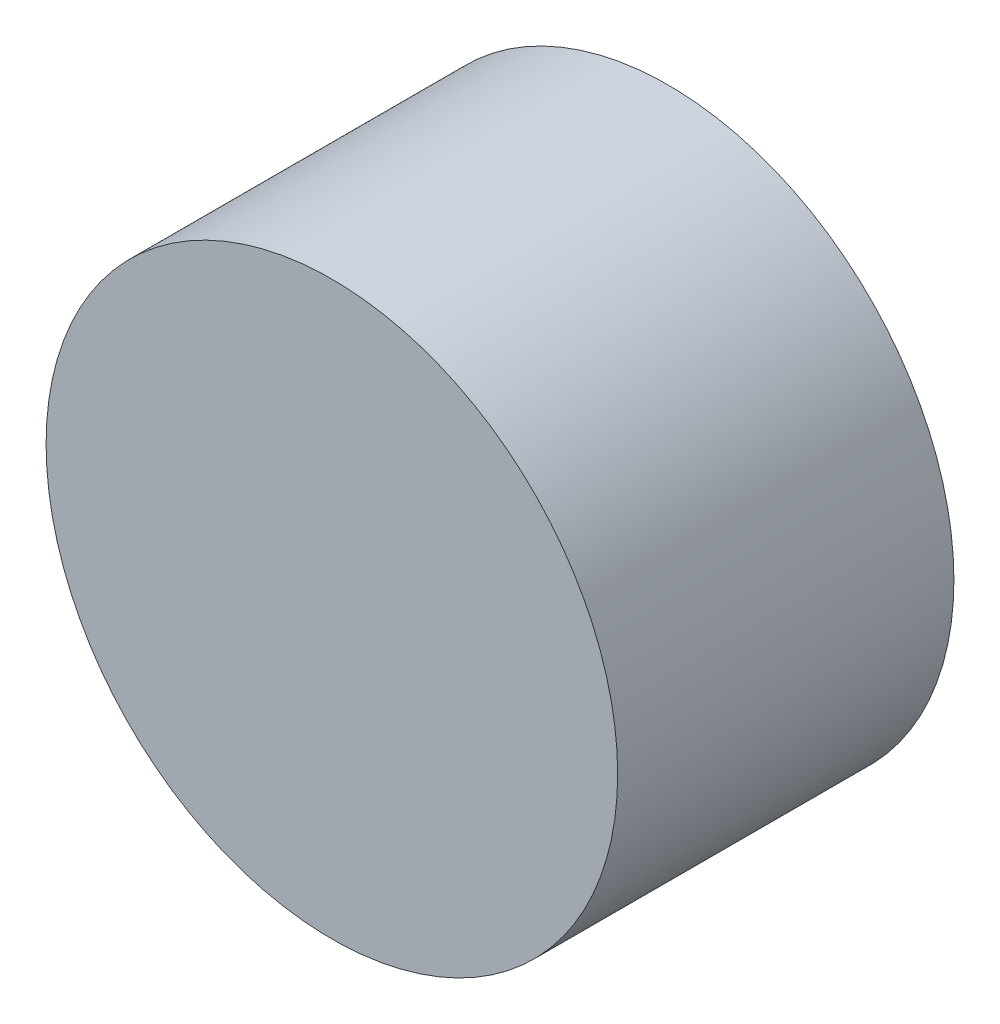
ISO-10303-21;
HEADER;
FILE_DESCRIPTION(('STEP AP214'),'2;1');
FILE_NAME('part.step','',(''),(''),'','','');
FILE_SCHEMA(('AUTOMOTIVE_DESIGN { 1 0 10303 214 1 1 1 1 }'));
ENDSEC;
DATA;
#1=APPLICATION_CONTEXT('core data for automotive mechanical design processes');
#2=APPLICATION_PROTOCOL_DEFINITION('international standard','automotive_design',2000,#1);
#3=PRODUCT_CONTEXT('',#1,'mechanical');
#4=PRODUCT('Part','Part','',(#3));
#5=PRODUCT_RELATED_PRODUCT_CATEGORY('part','',(#4));
#6=PRODUCT_DEFINITION_FORMATION('','',#4);
#7=PRODUCT_DEFINITION_CONTEXT('part definition',#1,'design');
#8=PRODUCT_DEFINITION('design','',#6,#7);
#9=PRODUCT_DEFINITION_SHAPE('','',#8);
#10=(LENGTH_UNIT() NAMED_UNIT(*) SI_UNIT(.MILLI.,.METRE.));
#11=(NAMED_UNIT(*) PLANE_ANGLE_UNIT() SI_UNIT($,.RADIAN.));
#12=(NAMED_UNIT(*) SI_UNIT($,.STERADIAN.) SOLID_ANGLE_UNIT());
#13=UNCERTAINTY_MEASURE_WITH_UNIT(LENGTH_MEASURE(1.E-05),#10,'distance_accuracy_value','');
#14=(GEOMETRIC_REPRESENTATION_CONTEXT(3) GLOBAL_UNCERTAINTY_ASSIGNED_CONTEXT((#13)) GLOBAL_UNIT_ASSIGNED_CONTEXT((#10,
#11,#12)) REPRESENTATION_CONTEXT('',''));
#15=CARTESIAN_POINT('',(0.,0.,0.));
#16=DIRECTION('',(0.,0.,1.));
#17=DIRECTION('',(1.,0.,0.));
#18=AXIS2_PLACEMENT_3D('',#15,#16,#17);
#19=CARTESIAN_POINT('',(0.85000084,0.,1.00000054));
#20=DIRECTION('',(0.,0.,-1.));
#21=DIRECTION('',(0.,-1.,0.));
#22=AXIS2_PLACEMENT_3D('',#19,#20,#21);
#23=PLANE('',#22);
#24=CARTESIAN_POINT('',(0.,0.,1.00000054));
#25=DIRECTION('',(0.,0.,1.));
#26=DIRECTION('',(1.,0.,0.));
#27=AXIS2_PLACEMENT_3D('',#24,#25,#26);
#28=CIRCLE('',#27,0.85000084);
#29=CARTESIAN_POINT('',(-0.85000084,0.,1.00000054));
#30=VERTEX_POINT('',#29);
#31=EDGE_CURVE('E11',#30,#30,#28,.T.);
#32=ORIENTED_EDGE('',*,*,#31,.T.);
#33=EDGE_LOOP('',(#32));
#34=FACE_BOUND('',#33,.T.);
#35=ADVANCED_FACE('F17',(#34),#23,.F.);
#36=CARTESIAN_POINT('',(0.85000084,0.,0.));
#37=DIRECTION('',(0.,0.,-1.));
#38=DIRECTION('',(0.,-1.,0.));
#39=AXIS2_PLACEMENT_3D('',#36,#37,#38);
#40=PLANE('',#39);
#41=CARTESIAN_POINT('',(0.,0.,0.));
#42=DIRECTION('',(0.,0.,1.));
#43=DIRECTION('',(1.,0.,0.));
#44=AXIS2_PLACEMENT_3D('',#41,#42,#43);
#45=CIRCLE('',#44,0.85000084);
#46=CARTESIAN_POINT('',(-0.85000084,0.,0.));
#47=VERTEX_POINT('',#46);
#48=EDGE_CURVE('E43',#47,#47,#45,.T.);
#49=ORIENTED_EDGE('',*,*,#48,.F.);
#50=EDGE_LOOP('',(#49));
#51=FACE_BOUND('',#50,.T.);
#52=ADVANCED_FACE('F59',(#51),#40,.T.);
#53=CARTESIAN_POINT('',(0.,0.,0.));
#54=DIRECTION('',(0.,0.,-1.));
#55=DIRECTION('',(1.,0.,0.));
#56=AXIS2_PLACEMENT_3D('',#53,#54,#55);
#57=CYLINDRICAL_SURFACE('',#56,0.85000084);
#58=ORIENTED_EDGE('',*,*,#48,.T.);
#59=DIRECTION('',(0.,0.,1.));
#60=VECTOR('',#59,1.);
#61=CARTESIAN_POINT('',(-0.85000084,0.,0.));
#62=LINE('',#61,#60);
#63=EDGE_CURVE('E21',#47,#30,#62,.T.);
#64=ORIENTED_EDGE('',*,*,#63,.T.);
#65=ORIENTED_EDGE('',*,*,#31,.F.);
#66=ORIENTED_EDGE('',*,*,#63,.F.);
#67=EDGE_LOOP('',(#58,#64,#65,#66));
#68=FACE_BOUND('',#67,.T.);
#69=ADVANCED_FACE('F19',(#68),#57,.T.);
#70=CLOSED_SHELL('',(#35,#52,#69));
#71=MANIFOLD_SOLID_BREP('B1',#70);
#72=ADVANCED_BREP_SHAPE_REPRESENTATION('',(#18,#71),#14);
#73=SHAPE_DEFINITION_REPRESENTATION(#9,#72);
ENDSEC;
END-ISO-10303-21;
